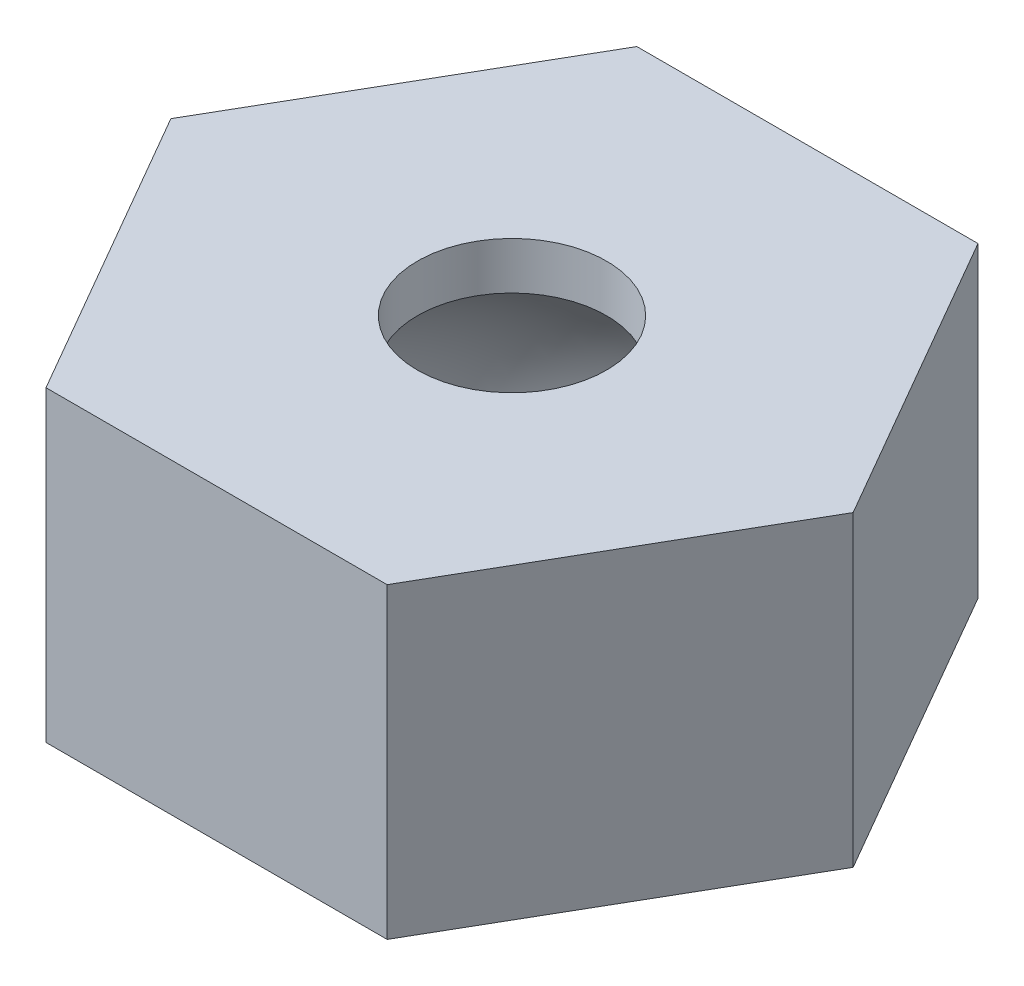
ISO-10303-21;
HEADER;
FILE_DESCRIPTION(('STEP AP214'),'2;1');
FILE_NAME('part.step','',(''),(''),'','','');
FILE_SCHEMA(('AUTOMOTIVE_DESIGN { 1 0 10303 214 1 1 1 1 }'));
ENDSEC;
DATA;
#1=APPLICATION_CONTEXT('core data for automotive mechanical design processes');
#2=APPLICATION_PROTOCOL_DEFINITION('international standard','automotive_design',2000,#1);
#3=PRODUCT_CONTEXT('',#1,'mechanical');
#4=PRODUCT('Part','Part','',(#3));
#5=PRODUCT_RELATED_PRODUCT_CATEGORY('part','',(#4));
#6=PRODUCT_DEFINITION_FORMATION('','',#4);
#7=PRODUCT_DEFINITION_CONTEXT('part definition',#1,'design');
#8=PRODUCT_DEFINITION('design','',#6,#7);
#9=PRODUCT_DEFINITION_SHAPE('','',#8);
#10=(LENGTH_UNIT() NAMED_UNIT(*) SI_UNIT(.MILLI.,.METRE.));
#11=(NAMED_UNIT(*) PLANE_ANGLE_UNIT() SI_UNIT($,.RADIAN.));
#12=(NAMED_UNIT(*) SI_UNIT($,.STERADIAN.) SOLID_ANGLE_UNIT());
#13=UNCERTAINTY_MEASURE_WITH_UNIT(LENGTH_MEASURE(1.E-05),#10,'distance_accuracy_value','');
#14=(GEOMETRIC_REPRESENTATION_CONTEXT(3) GLOBAL_UNCERTAINTY_ASSIGNED_CONTEXT((#13)) GLOBAL_UNIT_ASSIGNED_CONTEXT((#10,
#11,#12)) REPRESENTATION_CONTEXT('',''));
#15=CARTESIAN_POINT('',(0.,0.,0.));
#16=DIRECTION('',(0.,0.,1.));
#17=DIRECTION('',(1.,0.,0.));
#18=AXIS2_PLACEMENT_3D('',#15,#16,#17);
#19=CARTESIAN_POINT('',(0.,55.,0.));
#20=DIRECTION('',(0.,1.,0.));
#21=DIRECTION('',(0.,0.,1.));
#22=AXIS2_PLACEMENT_3D('',#19,#20,#21);
#23=PLANE('',#22);
#24=CARTESIAN_POINT('',(62.5,55.,0.));
#25=DIRECTION('',(0.,1.,0.));
#26=DIRECTION('',(0.,0.,1.));
#27=AXIS2_PLACEMENT_3D('',#24,#25,#26);
#28=CIRCLE('',#27,5.);
#29=CARTESIAN_POINT('',(62.5,55.,5.));
#30=VERTEX_POINT('',#29);
#31=EDGE_CURVE('E131',#30,#30,#28,.T.);
#32=ORIENTED_EDGE('',*,*,#31,.T.);
#33=EDGE_LOOP('',(#32));
#34=FACE_BOUND('',#33,.T.);
#35=CARTESIAN_POINT('',(31.25,55.,-54.1265877365274));
#36=DIRECTION('',(0.,1.,0.));
#37=DIRECTION('',(0.,0.,1.));
#38=AXIS2_PLACEMENT_3D('',#35,#36,#37);
#39=CIRCLE('',#38,5.00000000000001);
#40=CARTESIAN_POINT('',(31.25,55.,-49.1265877365274));
#41=VERTEX_POINT('',#40);
#42=EDGE_CURVE('E128',#41,#41,#39,.T.);
#43=ORIENTED_EDGE('',*,*,#42,.T.);
#44=EDGE_LOOP('',(#43));
#45=FACE_BOUND('',#44,.T.);
#46=CARTESIAN_POINT('',(-31.25,55.,-54.1265877365274));
#47=DIRECTION('',(0.,1.,0.));
#48=DIRECTION('',(0.,0.,1.));
#49=AXIS2_PLACEMENT_3D('',#46,#47,#48);
#50=CIRCLE('',#49,5.);
#51=CARTESIAN_POINT('',(-31.25,55.,-49.1265877365274));
#52=VERTEX_POINT('',#51);
#53=EDGE_CURVE('E138',#52,#52,#50,.T.);
#54=ORIENTED_EDGE('',*,*,#53,.T.);
#55=EDGE_LOOP('',(#54));
#56=FACE_BOUND('',#55,.T.);
#57=CARTESIAN_POINT('',(-62.5,55.,0.));
#58=DIRECTION('',(0.,1.,0.));
#59=DIRECTION('',(0.,0.,1.));
#60=AXIS2_PLACEMENT_3D('',#57,#58,#59);
#61=CIRCLE('',#60,5.);
#62=CARTESIAN_POINT('',(-62.5,55.,5.00000000000001));
#63=VERTEX_POINT('',#62);
#64=EDGE_CURVE('E155',#63,#63,#61,.T.);
#65=ORIENTED_EDGE('',*,*,#64,.T.);
#66=EDGE_LOOP('',(#65));
#67=FACE_BOUND('',#66,.T.);
#68=CARTESIAN_POINT('',(-31.25,55.,54.1265877365274));
#69=DIRECTION('',(0.,1.,0.));
#70=DIRECTION('',(0.,0.,1.));
#71=AXIS2_PLACEMENT_3D('',#68,#69,#70);
#72=CIRCLE('',#71,5.00000000000001);
#73=CARTESIAN_POINT('',(-31.25,55.,59.1265877365274));
#74=VERTEX_POINT('',#73);
#75=EDGE_CURVE('E149',#74,#74,#72,.T.);
#76=ORIENTED_EDGE('',*,*,#75,.T.);
#77=EDGE_LOOP('',(#76));
#78=FACE_BOUND('',#77,.T.);
#79=CARTESIAN_POINT('',(31.25,55.,54.1265877365274));
#80=DIRECTION('',(0.,1.,0.));
#81=DIRECTION('',(0.,0.,1.));
#82=AXIS2_PLACEMENT_3D('',#79,#80,#81);
#83=CIRCLE('',#82,5.00000000000001);
#84=CARTESIAN_POINT('',(31.25,55.,59.1265877365274));
#85=VERTEX_POINT('',#84);
#86=EDGE_CURVE('E143',#85,#85,#83,.T.);
#87=ORIENTED_EDGE('',*,*,#86,.T.);
#88=EDGE_LOOP('',(#87));
#89=FACE_BOUND('',#88,.T.);
#90=CARTESIAN_POINT('',(0.,55.,0.));
#91=DIRECTION('',(0.,1.,0.));
#92=DIRECTION('',(0.,0.,1.));
#93=AXIS2_PLACEMENT_3D('',#90,#91,#92);
#94=CIRCLE('',#93,54.8709661048334);
#95=CARTESIAN_POINT('',(0.,55.,54.8709661048334));
#96=VERTEX_POINT('',#95);
#97=EDGE_CURVE('E11',#96,#96,#94,.T.);
#98=ORIENTED_EDGE('',*,*,#97,.T.);
#99=EDGE_LOOP('',(#98));
#100=FACE_BOUND('',#99,.T.);
#101=DIRECTION('',(1.,0.,0.));
#102=VECTOR('',#101,1.);
#103=CARTESIAN_POINT('',(-36.0843918243516,55.,62.5));
#104=LINE('',#103,#102);
#105=CARTESIAN_POINT('',(-36.0843918243516,55.,62.5));
#106=VERTEX_POINT('',#105);
#107=CARTESIAN_POINT('',(36.0843918243516,55.,62.5));
#108=VERTEX_POINT('',#107);
#109=EDGE_CURVE('E95',#106,#108,#104,.T.);
#110=ORIENTED_EDGE('',*,*,#109,.F.);
#111=DIRECTION('',(0.5,0.,0.866025403784439));
#112=VECTOR('',#111,1.);
#113=CARTESIAN_POINT('',(-72.1687836487032,55.,0.));
#114=LINE('',#113,#112);
#115=CARTESIAN_POINT('',(-72.1687836487032,55.,0.));
#116=VERTEX_POINT('',#115);
#117=EDGE_CURVE('E175',#116,#106,#114,.T.);
#118=ORIENTED_EDGE('',*,*,#117,.F.);
#119=DIRECTION('',(-0.499999999999999,0.,0.866025403784439));
#120=VECTOR('',#119,1.);
#121=CARTESIAN_POINT('',(-36.0843918243516,55.,-62.5));
#122=LINE('',#121,#120);
#123=CARTESIAN_POINT('',(-36.0843918243516,55.,-62.5));
#124=VERTEX_POINT('',#123);
#125=EDGE_CURVE('E177',#124,#116,#122,.T.);
#126=ORIENTED_EDGE('',*,*,#125,.F.);
#127=DIRECTION('',(-1.,0.,0.));
#128=VECTOR('',#127,1.);
#129=CARTESIAN_POINT('',(36.0843918243516,55.,-62.5));
#130=LINE('',#129,#128);
#131=CARTESIAN_POINT('',(36.0843918243516,55.,-62.5));
#132=VERTEX_POINT('',#131);
#133=EDGE_CURVE('E179',#132,#124,#130,.T.);
#134=ORIENTED_EDGE('',*,*,#133,.F.);
#135=DIRECTION('',(-0.5,0.,-0.866025403784438));
#136=VECTOR('',#135,1.);
#137=CARTESIAN_POINT('',(72.1687836487032,55.,0.));
#138=LINE('',#137,#136);
#139=CARTESIAN_POINT('',(72.1687836487032,55.,0.));
#140=VERTEX_POINT('',#139);
#141=EDGE_CURVE('E57',#140,#132,#138,.T.);
#142=ORIENTED_EDGE('',*,*,#141,.F.);
#143=DIRECTION('',(0.499999999999999,0.,-0.866025403784439));
#144=VECTOR('',#143,1.);
#145=CARTESIAN_POINT('',(36.0843918243516,55.,62.5));
#146=LINE('',#145,#144);
#147=EDGE_CURVE('E39',#108,#140,#146,.T.);
#148=ORIENTED_EDGE('',*,*,#147,.F.);
#149=EDGE_LOOP('',(#110,#118,#126,#134,#142,#148));
#150=FACE_BOUND('',#149,.T.);
#151=ADVANCED_FACE('F36',(#34,#45,#56,#67,#78,#89,#100,#150),#23,.F.);
#152=CARTESIAN_POINT('',(72.1687836487032,110.,0.));
#153=DIRECTION('',(-0.866025403784438,0.,0.5));
#154=DIRECTION('',(0.5,0.,0.866025403784438));
#155=AXIS2_PLACEMENT_3D('',#152,#153,#154);
#156=PLANE('',#155);
#157=DIRECTION('',(0.,-1.,0.));
#158=VECTOR('',#157,1.);
#159=CARTESIAN_POINT('',(72.1687836487032,110.,0.));
#160=LINE('',#159,#158);
#161=CARTESIAN_POINT('',(72.1687836487032,120.,0.));
#162=VERTEX_POINT('',#161);
#163=EDGE_CURVE('E102',#162,#140,#160,.T.);
#164=ORIENTED_EDGE('',*,*,#163,.T.);
#165=ORIENTED_EDGE('',*,*,#141,.T.);
#166=DIRECTION('',(0.,-1.,0.));
#167=VECTOR('',#166,1.);
#168=CARTESIAN_POINT('',(36.0843918243516,110.,-62.5));
#169=LINE('',#168,#167);
#170=CARTESIAN_POINT('',(36.0843918243516,120.,-62.5));
#171=VERTEX_POINT('',#170);
#172=EDGE_CURVE('E170',#171,#132,#169,.T.);
#173=ORIENTED_EDGE('',*,*,#172,.F.);
#174=DIRECTION('',(-0.5,0.,-0.866025403784438));
#175=VECTOR('',#174,1.);
#176=CARTESIAN_POINT('',(72.1687836487032,120.,0.));
#177=LINE('',#176,#175);
#178=EDGE_CURVE('E106',#162,#171,#177,.T.);
#179=ORIENTED_EDGE('',*,*,#178,.F.);
#180=EDGE_LOOP('',(#164,#165,#173,#179));
#181=FACE_BOUND('',#180,.T.);
#182=ADVANCED_FACE('F191',(#181),#156,.F.);
#183=CARTESIAN_POINT('',(36.0843918243516,110.,-62.5));
#184=DIRECTION('',(0.,0.,1.));
#185=DIRECTION('',(1.,0.,0.));
#186=AXIS2_PLACEMENT_3D('',#183,#184,#185);
#187=PLANE('',#186);
#188=ORIENTED_EDGE('',*,*,#172,.T.);
#189=ORIENTED_EDGE('',*,*,#133,.T.);
#190=DIRECTION('',(0.,-1.,0.));
#191=VECTOR('',#190,1.);
#192=CARTESIAN_POINT('',(-36.0843918243516,110.,-62.5));
#193=LINE('',#192,#191);
#194=CARTESIAN_POINT('',(-36.0843918243516,120.,-62.5));
#195=VERTEX_POINT('',#194);
#196=EDGE_CURVE('E167',#195,#124,#193,.T.);
#197=ORIENTED_EDGE('',*,*,#196,.F.);
#198=DIRECTION('',(-1.,0.,0.));
#199=VECTOR('',#198,1.);
#200=CARTESIAN_POINT('',(36.0843918243516,120.,-62.5));
#201=LINE('',#200,#199);
#202=EDGE_CURVE('E122',#171,#195,#201,.T.);
#203=ORIENTED_EDGE('',*,*,#202,.F.);
#204=EDGE_LOOP('',(#188,#189,#197,#203));
#205=FACE_BOUND('',#204,.T.);
#206=ADVANCED_FACE('F182',(#205),#187,.F.);
#207=CARTESIAN_POINT('',(-36.0843918243516,110.,-62.5));
#208=DIRECTION('',(0.866025403784439,0.,0.499999999999999));
#209=DIRECTION('',(0.499999999999999,0.,-0.866025403784439));
#210=AXIS2_PLACEMENT_3D('',#207,#208,#209);
#211=PLANE('',#210);
#212=ORIENTED_EDGE('',*,*,#196,.T.);
#213=ORIENTED_EDGE('',*,*,#125,.T.);
#214=DIRECTION('',(0.,-1.,0.));
#215=VECTOR('',#214,1.);
#216=CARTESIAN_POINT('',(-72.1687836487032,110.,0.));
#217=LINE('',#216,#215);
#218=CARTESIAN_POINT('',(-72.1687836487032,120.,0.));
#219=VERTEX_POINT('',#218);
#220=EDGE_CURVE('E164',#219,#116,#217,.T.);
#221=ORIENTED_EDGE('',*,*,#220,.F.);
#222=DIRECTION('',(-0.499999999999999,0.,0.866025403784439));
#223=VECTOR('',#222,1.);
#224=CARTESIAN_POINT('',(-36.0843918243516,120.,-62.5));
#225=LINE('',#224,#223);
#226=EDGE_CURVE('E125',#195,#219,#225,.T.);
#227=ORIENTED_EDGE('',*,*,#226,.F.);
#228=EDGE_LOOP('',(#212,#213,#221,#227));
#229=FACE_BOUND('',#228,.T.);
#230=ADVANCED_FACE('F188',(#229),#211,.F.);
#231=CARTESIAN_POINT('',(0.,58.765246170202,0.));
#232=DIRECTION('',(0.,1.,0.));
#233=DIRECTION('',(0.,0.,-1.));
#234=AXIS2_PLACEMENT_3D('',#231,#232,#233);
#235=SPHERICAL_SURFACE('',#234,55.);
#236=ORIENTED_EDGE('',*,*,#97,.F.);
#237=EDGE_LOOP('',(#236));
#238=FACE_BOUND('',#237,.T.);
#239=CARTESIAN_POINT('',(0.,110.,0.));
#240=DIRECTION('',(0.,1.,0.));
#241=DIRECTION('',(0.,0.,1.));
#242=AXIS2_PLACEMENT_3D('',#239,#240,#241);
#243=CIRCLE('',#242,20.);
#244=CARTESIAN_POINT('',(0.,110.,19.9999999999999));
#245=VERTEX_POINT('',#244);
#246=EDGE_CURVE('E117',#245,#245,#243,.T.);
#247=ORIENTED_EDGE('',*,*,#246,.T.);
#248=EDGE_LOOP('',(#247));
#249=FACE_BOUND('',#248,.T.);
#250=ADVANCED_FACE('F240',(#238,#249),#235,.F.);
#251=CARTESIAN_POINT('',(36.0843918243516,110.,62.5));
#252=DIRECTION('',(-0.866025403784439,0.,-0.499999999999999));
#253=DIRECTION('',(-0.499999999999999,0.,0.866025403784439));
#254=AXIS2_PLACEMENT_3D('',#251,#252,#253);
#255=PLANE('',#254);
#256=DIRECTION('',(0.,-1.,0.));
#257=VECTOR('',#256,1.);
#258=CARTESIAN_POINT('',(36.0843918243516,110.,62.5));
#259=LINE('',#258,#257);
#260=CARTESIAN_POINT('',(36.0843918243516,120.,62.5));
#261=VERTEX_POINT('',#260);
#262=EDGE_CURVE('E88',#261,#108,#259,.T.);
#263=ORIENTED_EDGE('',*,*,#262,.T.);
#264=ORIENTED_EDGE('',*,*,#147,.T.);
#265=ORIENTED_EDGE('',*,*,#163,.F.);
#266=DIRECTION('',(0.499999999999999,0.,-0.866025403784439));
#267=VECTOR('',#266,1.);
#268=CARTESIAN_POINT('',(36.0843918243516,120.,62.5));
#269=LINE('',#268,#267);
#270=EDGE_CURVE('E100',#261,#162,#269,.T.);
#271=ORIENTED_EDGE('',*,*,#270,.F.);
#272=EDGE_LOOP('',(#263,#264,#265,#271));
#273=FACE_BOUND('',#272,.T.);
#274=ADVANCED_FACE('F101',(#273),#255,.F.);
#275=CARTESIAN_POINT('',(-72.1687836487032,110.,0.));
#276=DIRECTION('',(0.866025403784439,0.,-0.5));
#277=DIRECTION('',(-0.5,0.,-0.866025403784439));
#278=AXIS2_PLACEMENT_3D('',#275,#276,#277);
#279=PLANE('',#278);
#280=ORIENTED_EDGE('',*,*,#220,.T.);
#281=ORIENTED_EDGE('',*,*,#117,.T.);
#282=DIRECTION('',(0.,-1.,0.));
#283=VECTOR('',#282,1.);
#284=CARTESIAN_POINT('',(-36.0843918243516,110.,62.5));
#285=LINE('',#284,#283);
#286=CARTESIAN_POINT('',(-36.0843918243516,120.,62.5));
#287=VERTEX_POINT('',#286);
#288=EDGE_CURVE('E96',#287,#106,#285,.T.);
#289=ORIENTED_EDGE('',*,*,#288,.F.);
#290=DIRECTION('',(0.5,0.,0.866025403784438));
#291=VECTOR('',#290,1.);
#292=CARTESIAN_POINT('',(-72.1687836487032,120.,0.));
#293=LINE('',#292,#291);
#294=EDGE_CURVE('E113',#219,#287,#293,.T.);
#295=ORIENTED_EDGE('',*,*,#294,.F.);
#296=EDGE_LOOP('',(#280,#281,#289,#295));
#297=FACE_BOUND('',#296,.T.);
#298=ADVANCED_FACE('F190',(#297),#279,.F.);
#299=CARTESIAN_POINT('',(-36.0843918243516,110.,62.5));
#300=DIRECTION('',(0.,0.,-1.));
#301=DIRECTION('',(-1.,0.,0.));
#302=AXIS2_PLACEMENT_3D('',#299,#300,#301);
#303=PLANE('',#302);
#304=ORIENTED_EDGE('',*,*,#288,.T.);
#305=ORIENTED_EDGE('',*,*,#109,.T.);
#306=ORIENTED_EDGE('',*,*,#262,.F.);
#307=DIRECTION('',(1.,0.,0.));
#308=VECTOR('',#307,1.);
#309=CARTESIAN_POINT('',(-36.0843918243516,120.,62.5));
#310=LINE('',#309,#308);
#311=EDGE_CURVE('E93',#287,#261,#310,.T.);
#312=ORIENTED_EDGE('',*,*,#311,.F.);
#313=EDGE_LOOP('',(#304,#305,#306,#312));
#314=FACE_BOUND('',#313,.T.);
#315=ADVANCED_FACE('F91',(#314),#303,.F.);
#316=CARTESIAN_POINT('',(31.25,66.,54.1265877365274));
#317=DIRECTION('',(0.,-1.,0.));
#318=DIRECTION('',(0.,0.,-1.));
#319=AXIS2_PLACEMENT_3D('',#316,#317,#318);
#320=CYLINDRICAL_SURFACE('',#319,5.00000000000001);
#321=CARTESIAN_POINT('',(31.25,66.,54.1265877365274));
#322=DIRECTION('',(0.,1.,0.));
#323=DIRECTION('',(0.,0.,1.));
#324=AXIS2_PLACEMENT_3D('',#321,#322,#323);
#325=CIRCLE('',#324,5.00000000000001);
#326=CARTESIAN_POINT('',(31.25,66.,59.1265877365274));
#327=VERTEX_POINT('',#326);
#328=EDGE_CURVE('E134',#327,#327,#325,.T.);
#329=ORIENTED_EDGE('',*,*,#328,.T.);
#330=EDGE_LOOP('',(#329));
#331=FACE_BOUND('',#330,.T.);
#332=ORIENTED_EDGE('',*,*,#86,.F.);
#333=EDGE_LOOP('',(#332));
#334=FACE_BOUND('',#333,.T.);
#335=ADVANCED_FACE('F194',(#331,#334),#320,.F.);
#336=CARTESIAN_POINT('',(31.25,66.,54.1265877365274));
#337=DIRECTION('',(0.,1.,0.));
#338=DIRECTION('',(0.,0.,1.));
#339=AXIS2_PLACEMENT_3D('',#336,#337,#338);
#340=PLANE('',#339);
#341=ORIENTED_EDGE('',*,*,#328,.F.);
#342=EDGE_LOOP('',(#341));
#343=FACE_BOUND('',#342,.T.);
#344=ADVANCED_FACE('F202',(#343),#340,.F.);
#345=CARTESIAN_POINT('',(-31.25,66.,54.1265877365274));
#346=DIRECTION('',(0.,-1.,0.));
#347=DIRECTION('',(0.,0.,-1.));
#348=AXIS2_PLACEMENT_3D('',#345,#346,#347);
#349=CYLINDRICAL_SURFACE('',#348,5.00000000000001);
#350=CARTESIAN_POINT('',(-31.25,66.,54.1265877365274));
#351=DIRECTION('',(0.,1.,0.));
#352=DIRECTION('',(0.,0.,1.));
#353=AXIS2_PLACEMENT_3D('',#350,#351,#352);
#354=CIRCLE('',#353,5.00000000000001);
#355=CARTESIAN_POINT('',(-31.25,66.,59.1265877365274));
#356=VERTEX_POINT('',#355);
#357=EDGE_CURVE('E146',#356,#356,#354,.T.);
#358=ORIENTED_EDGE('',*,*,#357,.T.);
#359=EDGE_LOOP('',(#358));
#360=FACE_BOUND('',#359,.T.);
#361=ORIENTED_EDGE('',*,*,#75,.F.);
#362=EDGE_LOOP('',(#361));
#363=FACE_BOUND('',#362,.T.);
#364=ADVANCED_FACE('F209',(#360,#363),#349,.F.);
#365=CARTESIAN_POINT('',(-31.25,66.,54.1265877365274));
#366=DIRECTION('',(0.,1.,0.));
#367=DIRECTION('',(0.,0.,1.));
#368=AXIS2_PLACEMENT_3D('',#365,#366,#367);
#369=PLANE('',#368);
#370=ORIENTED_EDGE('',*,*,#357,.F.);
#371=EDGE_LOOP('',(#370));
#372=FACE_BOUND('',#371,.T.);
#373=ADVANCED_FACE('F216',(#372),#369,.F.);
#374=CARTESIAN_POINT('',(-62.5,66.,0.));
#375=DIRECTION('',(0.,-1.,0.));
#376=DIRECTION('',(0.,0.,-1.));
#377=AXIS2_PLACEMENT_3D('',#374,#375,#376);
#378=CYLINDRICAL_SURFACE('',#377,5.);
#379=CARTESIAN_POINT('',(-62.5,66.,0.));
#380=DIRECTION('',(0.,1.,0.));
#381=DIRECTION('',(0.,0.,1.));
#382=AXIS2_PLACEMENT_3D('',#379,#380,#381);
#383=CIRCLE('',#382,5.);
#384=CARTESIAN_POINT('',(-62.5,66.,5.00000000000001));
#385=VERTEX_POINT('',#384);
#386=EDGE_CURVE('E152',#385,#385,#383,.T.);
#387=ORIENTED_EDGE('',*,*,#386,.T.);
#388=EDGE_LOOP('',(#387));
#389=FACE_BOUND('',#388,.T.);
#390=ORIENTED_EDGE('',*,*,#64,.F.);
#391=EDGE_LOOP('',(#390));
#392=FACE_BOUND('',#391,.T.);
#393=ADVANCED_FACE('F219',(#389,#392),#378,.F.);
#394=CARTESIAN_POINT('',(-62.5,66.,0.));
#395=DIRECTION('',(0.,1.,0.));
#396=DIRECTION('',(0.,0.,1.));
#397=AXIS2_PLACEMENT_3D('',#394,#395,#396);
#398=PLANE('',#397);
#399=ORIENTED_EDGE('',*,*,#386,.F.);
#400=EDGE_LOOP('',(#399));
#401=FACE_BOUND('',#400,.T.);
#402=ADVANCED_FACE('F224',(#401),#398,.F.);
#403=CARTESIAN_POINT('',(-31.25,66.,-54.1265877365274));
#404=DIRECTION('',(0.,-1.,0.));
#405=DIRECTION('',(0.,0.,-1.));
#406=AXIS2_PLACEMENT_3D('',#403,#404,#405);
#407=CYLINDRICAL_SURFACE('',#406,5.);
#408=CARTESIAN_POINT('',(-31.25,66.,-54.1265877365274));
#409=DIRECTION('',(0.,1.,0.));
#410=DIRECTION('',(0.,0.,1.));
#411=AXIS2_PLACEMENT_3D('',#408,#409,#410);
#412=CIRCLE('',#411,5.);
#413=CARTESIAN_POINT('',(-31.25,66.,-49.1265877365274));
#414=VERTEX_POINT('',#413);
#415=EDGE_CURVE('E158',#414,#414,#412,.T.);
#416=ORIENTED_EDGE('',*,*,#415,.T.);
#417=EDGE_LOOP('',(#416));
#418=FACE_BOUND('',#417,.T.);
#419=ORIENTED_EDGE('',*,*,#53,.F.);
#420=EDGE_LOOP('',(#419));
#421=FACE_BOUND('',#420,.T.);
#422=ADVANCED_FACE('F227',(#418,#421),#407,.F.);
#423=CARTESIAN_POINT('',(-31.25,66.,-54.1265877365274));
#424=DIRECTION('',(0.,1.,0.));
#425=DIRECTION('',(0.,0.,1.));
#426=AXIS2_PLACEMENT_3D('',#423,#424,#425);
#427=PLANE('',#426);
#428=ORIENTED_EDGE('',*,*,#415,.F.);
#429=EDGE_LOOP('',(#428));
#430=FACE_BOUND('',#429,.T.);
#431=ADVANCED_FACE('F232',(#430),#427,.F.);
#432=CARTESIAN_POINT('',(31.25,66.,-54.1265877365274));
#433=DIRECTION('',(0.,-1.,0.));
#434=DIRECTION('',(0.,0.,-1.));
#435=AXIS2_PLACEMENT_3D('',#432,#433,#434);
#436=CYLINDRICAL_SURFACE('',#435,5.00000000000001);
#437=CARTESIAN_POINT('',(31.25,66.,-54.1265877365274));
#438=DIRECTION('',(0.,1.,0.));
#439=DIRECTION('',(0.,0.,1.));
#440=AXIS2_PLACEMENT_3D('',#437,#438,#439);
#441=CIRCLE('',#440,5.00000000000001);
#442=CARTESIAN_POINT('',(31.25,66.,-49.1265877365274));
#443=VERTEX_POINT('',#442);
#444=EDGE_CURVE('E135',#443,#443,#441,.T.);
#445=ORIENTED_EDGE('',*,*,#444,.T.);
#446=EDGE_LOOP('',(#445));
#447=FACE_BOUND('',#446,.T.);
#448=ORIENTED_EDGE('',*,*,#42,.F.);
#449=EDGE_LOOP('',(#448));
#450=FACE_BOUND('',#449,.T.);
#451=ADVANCED_FACE('F235',(#447,#450),#436,.F.);
#452=CARTESIAN_POINT('',(31.25,66.,-54.1265877365274));
#453=DIRECTION('',(0.,1.,0.));
#454=DIRECTION('',(0.,0.,1.));
#455=AXIS2_PLACEMENT_3D('',#452,#453,#454);
#456=PLANE('',#455);
#457=ORIENTED_EDGE('',*,*,#444,.F.);
#458=EDGE_LOOP('',(#457));
#459=FACE_BOUND('',#458,.T.);
#460=ADVANCED_FACE('F331',(#459),#456,.F.);
#461=CARTESIAN_POINT('',(62.5,66.,0.));
#462=DIRECTION('',(0.,-1.,0.));
#463=DIRECTION('',(0.,0.,-1.));
#464=AXIS2_PLACEMENT_3D('',#461,#462,#463);
#465=CYLINDRICAL_SURFACE('',#464,5.);
#466=CARTESIAN_POINT('',(62.5,66.,0.));
#467=DIRECTION('',(0.,1.,0.));
#468=DIRECTION('',(0.,0.,1.));
#469=AXIS2_PLACEMENT_3D('',#466,#467,#468);
#470=CIRCLE('',#469,5.);
#471=CARTESIAN_POINT('',(62.5,66.,5.));
#472=VERTEX_POINT('',#471);
#473=EDGE_CURVE('E97',#472,#472,#470,.T.);
#474=ORIENTED_EDGE('',*,*,#473,.T.);
#475=EDGE_LOOP('',(#474));
#476=FACE_BOUND('',#475,.T.);
#477=ORIENTED_EDGE('',*,*,#31,.F.);
#478=EDGE_LOOP('',(#477));
#479=FACE_BOUND('',#478,.T.);
#480=ADVANCED_FACE('F340',(#476,#479),#465,.F.);
#481=CARTESIAN_POINT('',(62.5,66.,0.));
#482=DIRECTION('',(0.,1.,0.));
#483=DIRECTION('',(0.,0.,1.));
#484=AXIS2_PLACEMENT_3D('',#481,#482,#483);
#485=PLANE('',#484);
#486=ORIENTED_EDGE('',*,*,#473,.F.);
#487=EDGE_LOOP('',(#486));
#488=FACE_BOUND('',#487,.T.);
#489=ADVANCED_FACE('F350',(#488),#485,.F.);
#490=CARTESIAN_POINT('',(0.,120.,0.));
#491=DIRECTION('',(0.,1.,0.));
#492=DIRECTION('',(0.,0.,1.));
#493=AXIS2_PLACEMENT_3D('',#490,#491,#492);
#494=PLANE('',#493);
#495=ORIENTED_EDGE('',*,*,#311,.T.);
#496=ORIENTED_EDGE('',*,*,#270,.T.);
#497=ORIENTED_EDGE('',*,*,#178,.T.);
#498=ORIENTED_EDGE('',*,*,#202,.T.);
#499=ORIENTED_EDGE('',*,*,#226,.T.);
#500=ORIENTED_EDGE('',*,*,#294,.T.);
#501=EDGE_LOOP('',(#495,#496,#497,#498,#499,#500));
#502=FACE_BOUND('',#501,.T.);
#503=CARTESIAN_POINT('',(0.,120.,0.));
#504=DIRECTION('',(0.,1.,0.));
#505=DIRECTION('',(0.,0.,1.));
#506=AXIS2_PLACEMENT_3D('',#503,#504,#505);
#507=CIRCLE('',#506,20.);
#508=CARTESIAN_POINT('',(0.,120.,19.9999999999999));
#509=VERTEX_POINT('',#508);
#510=EDGE_CURVE('E114',#509,#509,#507,.T.);
#511=ORIENTED_EDGE('',*,*,#510,.F.);
#512=EDGE_LOOP('',(#511));
#513=FACE_BOUND('',#512,.T.);
#514=ADVANCED_FACE('F109',(#502,#513),#494,.T.);
#515=CARTESIAN_POINT('',(0.,120.,0.));
#516=DIRECTION('',(0.,-1.,0.));
#517=DIRECTION('',(0.,0.,-1.));
#518=AXIS2_PLACEMENT_3D('',#515,#516,#517);
#519=CYLINDRICAL_SURFACE('',#518,20.);
#520=ORIENTED_EDGE('',*,*,#510,.T.);
#521=EDGE_LOOP('',(#520));
#522=FACE_BOUND('',#521,.T.);
#523=ORIENTED_EDGE('',*,*,#246,.F.);
#524=EDGE_LOOP('',(#523));
#525=FACE_BOUND('',#524,.T.);
#526=ADVANCED_FACE('F370',(#522,#525),#519,.F.);
#527=CLOSED_SHELL('',(#151,#182,#206,#230,#250,#274,#298,#315,#335,#344,#364,#373,#393,#402,
#422,#431,#451,#460,#480,#489,#514,#526));
#528=MANIFOLD_SOLID_BREP('B2',#527);
#529=ADVANCED_BREP_SHAPE_REPRESENTATION('',(#18,#528),#14);
#530=SHAPE_DEFINITION_REPRESENTATION(#9,#529);
ENDSEC;
END-ISO-10303-21;
